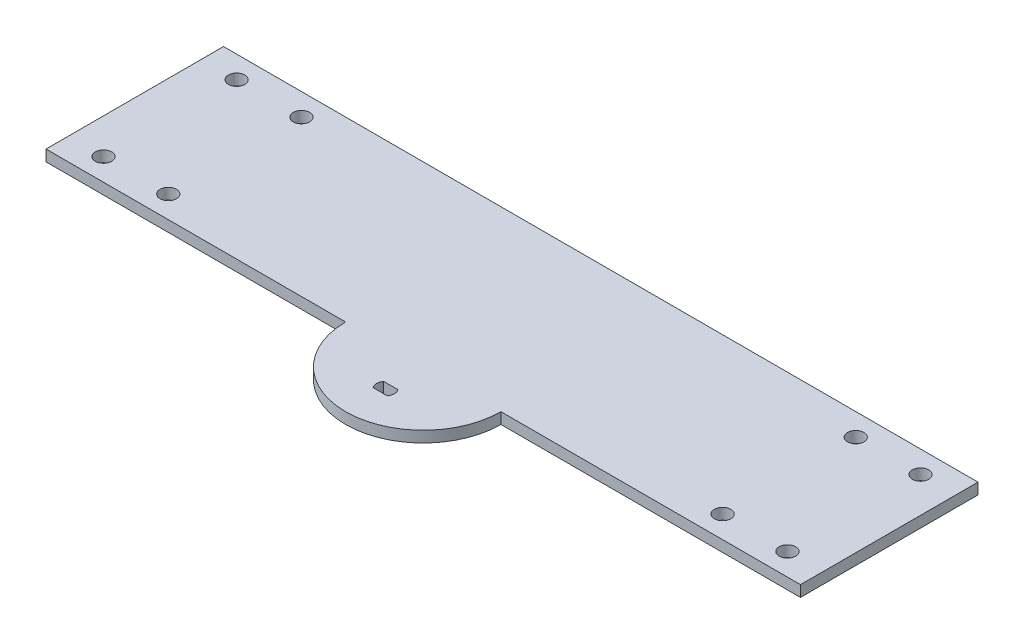
ISO-10303-21;
HEADER;
FILE_DESCRIPTION(('STEP AP214'),'2;1');
FILE_NAME('part.step','',(''),(''),'','','');
FILE_SCHEMA(('AUTOMOTIVE_DESIGN { 1 0 10303 214 1 1 1 1 }'));
ENDSEC;
DATA;
#1=APPLICATION_CONTEXT('core data for automotive mechanical design processes');
#2=APPLICATION_PROTOCOL_DEFINITION('international standard','automotive_design',2000,#1);
#3=PRODUCT_CONTEXT('',#1,'mechanical');
#4=PRODUCT('Part','Part','',(#3));
#5=PRODUCT_RELATED_PRODUCT_CATEGORY('part','',(#4));
#6=PRODUCT_DEFINITION_FORMATION('','',#4);
#7=PRODUCT_DEFINITION_CONTEXT('part definition',#1,'design');
#8=PRODUCT_DEFINITION('design','',#6,#7);
#9=PRODUCT_DEFINITION_SHAPE('','',#8);
#10=(LENGTH_UNIT() NAMED_UNIT(*) SI_UNIT(.MILLI.,.METRE.));
#11=(NAMED_UNIT(*) PLANE_ANGLE_UNIT() SI_UNIT($,.RADIAN.));
#12=(NAMED_UNIT(*) SI_UNIT($,.STERADIAN.) SOLID_ANGLE_UNIT());
#13=UNCERTAINTY_MEASURE_WITH_UNIT(LENGTH_MEASURE(1.E-05),#10,'distance_accuracy_value','');
#14=(GEOMETRIC_REPRESENTATION_CONTEXT(3) GLOBAL_UNCERTAINTY_ASSIGNED_CONTEXT((#13)) GLOBAL_UNIT_ASSIGNED_CONTEXT((#10,
#11,#12)) REPRESENTATION_CONTEXT('',''));
#15=CARTESIAN_POINT('',(0.,0.,0.));
#16=DIRECTION('',(0.,0.,1.));
#17=DIRECTION('',(1.,0.,0.));
#18=AXIS2_PLACEMENT_3D('',#15,#16,#17);
#19=CARTESIAN_POINT('',(0.,3.175,-10.795));
#20=DIRECTION('',(0.,1.,0.));
#21=DIRECTION('',(0.,0.,1.));
#22=AXIS2_PLACEMENT_3D('',#19,#20,#21);
#23=PLANE('',#22);
#24=CARTESIAN_POINT('',(-97.8535,3.175,-17.145));
#25=DIRECTION('',(0.,1.,0.));
#26=DIRECTION('',(0.,0.,1.));
#27=AXIS2_PLACEMENT_3D('',#24,#25,#26);
#28=CIRCLE('',#27,2.3495);
#29=CARTESIAN_POINT('',(-97.8535,3.175,-14.7955));
#30=VERTEX_POINT('',#29);
#31=EDGE_CURVE('E311',#30,#30,#28,.T.);
#32=ORIENTED_EDGE('',*,*,#31,.F.);
#33=EDGE_LOOP('',(#32));
#34=FACE_BOUND('',#33,.T.);
#35=CARTESIAN_POINT('',(-79.3115,3.175,-17.145));
#36=DIRECTION('',(0.,1.,0.));
#37=DIRECTION('',(0.,0.,1.));
#38=AXIS2_PLACEMENT_3D('',#35,#36,#37);
#39=CIRCLE('',#38,2.3495);
#40=CARTESIAN_POINT('',(-79.3115,3.175,-14.7955));
#41=VERTEX_POINT('',#40);
#42=EDGE_CURVE('E318',#41,#41,#39,.T.);
#43=ORIENTED_EDGE('',*,*,#42,.F.);
#44=EDGE_LOOP('',(#43));
#45=FACE_BOUND('',#44,.T.);
#46=CARTESIAN_POINT('',(-79.3115,3.175,-55.245));
#47=DIRECTION('',(0.,1.,0.));
#48=DIRECTION('',(0.,0.,1.));
#49=AXIS2_PLACEMENT_3D('',#46,#47,#48);
#50=CIRCLE('',#49,2.3495);
#51=CARTESIAN_POINT('',(-79.3115,3.175,-52.8955));
#52=VERTEX_POINT('',#51);
#53=EDGE_CURVE('E324',#52,#52,#50,.T.);
#54=ORIENTED_EDGE('',*,*,#53,.F.);
#55=EDGE_LOOP('',(#54));
#56=FACE_BOUND('',#55,.T.);
#57=CARTESIAN_POINT('',(79.3115,3.175,-55.245));
#58=DIRECTION('',(0.,1.,0.));
#59=DIRECTION('',(0.,0.,-1.));
#60=AXIS2_PLACEMENT_3D('',#57,#58,#59);
#61=CIRCLE('',#60,2.3495);
#62=CARTESIAN_POINT('',(79.3115,3.175,-57.5945));
#63=VERTEX_POINT('',#62);
#64=EDGE_CURVE('E295',#63,#63,#61,.T.);
#65=ORIENTED_EDGE('',*,*,#64,.F.);
#66=EDGE_LOOP('',(#65));
#67=FACE_BOUND('',#66,.T.);
#68=CARTESIAN_POINT('',(79.3115,3.175,-17.145));
#69=DIRECTION('',(0.,1.,0.));
#70=DIRECTION('',(0.,0.,-1.));
#71=AXIS2_PLACEMENT_3D('',#68,#69,#70);
#72=CIRCLE('',#71,2.3495);
#73=CARTESIAN_POINT('',(79.3115,3.175,-19.4945));
#74=VERTEX_POINT('',#73);
#75=EDGE_CURVE('E290',#74,#74,#72,.T.);
#76=ORIENTED_EDGE('',*,*,#75,.F.);
#77=EDGE_LOOP('',(#76));
#78=FACE_BOUND('',#77,.T.);
#79=CARTESIAN_POINT('',(97.8535,3.175,-17.145));
#80=DIRECTION('',(0.,1.,0.));
#81=DIRECTION('',(0.,0.,-1.));
#82=AXIS2_PLACEMENT_3D('',#79,#80,#81);
#83=CIRCLE('',#82,2.3495);
#84=CARTESIAN_POINT('',(97.8535,3.175,-19.4945));
#85=VERTEX_POINT('',#84);
#86=EDGE_CURVE('E297',#85,#85,#83,.T.);
#87=ORIENTED_EDGE('',*,*,#86,.F.);
#88=EDGE_LOOP('',(#87));
#89=FACE_BOUND('',#88,.T.);
#90=CARTESIAN_POINT('',(97.8535,3.175,-55.245));
#91=DIRECTION('',(0.,1.,0.));
#92=DIRECTION('',(0.,0.,-1.));
#93=AXIS2_PLACEMENT_3D('',#90,#91,#92);
#94=CIRCLE('',#93,2.3495);
#95=CARTESIAN_POINT('',(97.8535,3.175,-57.5945));
#96=VERTEX_POINT('',#95);
#97=EDGE_CURVE('E305',#96,#96,#94,.T.);
#98=ORIENTED_EDGE('',*,*,#97,.F.);
#99=EDGE_LOOP('',(#98));
#100=FACE_BOUND('',#99,.T.);
#101=CARTESIAN_POINT('',(-97.8535,3.175,-55.245));
#102=DIRECTION('',(0.,1.,0.));
#103=DIRECTION('',(0.,0.,1.));
#104=AXIS2_PLACEMENT_3D('',#101,#102,#103);
#105=CIRCLE('',#104,2.3495);
#106=CARTESIAN_POINT('',(-97.8535,3.175,-52.8955));
#107=VERTEX_POINT('',#106);
#108=EDGE_CURVE('E314',#107,#107,#105,.T.);
#109=ORIENTED_EDGE('',*,*,#108,.F.);
#110=EDGE_LOOP('',(#109));
#111=FACE_BOUND('',#110,.T.);
#112=DIRECTION('',(1.,0.,0.));
#113=VECTOR('',#112,1.);
#114=CARTESIAN_POINT('',(22.225,3.175,-10.795));
#115=LINE('',#114,#113);
#116=CARTESIAN_POINT('',(22.225,3.175,-10.795));
#117=VERTEX_POINT('',#116);
#118=CARTESIAN_POINT('',(107.95,3.175,-10.795));
#119=VERTEX_POINT('',#118);
#120=EDGE_CURVE('E155',#117,#119,#115,.T.);
#121=ORIENTED_EDGE('',*,*,#120,.T.);
#122=DIRECTION('',(0.,0.,-1.));
#123=VECTOR('',#122,1.);
#124=CARTESIAN_POINT('',(107.95,3.175,-61.595));
#125=LINE('',#124,#123);
#126=CARTESIAN_POINT('',(107.95,3.175,-61.595));
#127=VERTEX_POINT('',#126);
#128=EDGE_CURVE('E158',#119,#127,#125,.T.);
#129=ORIENTED_EDGE('',*,*,#128,.T.);
#130=DIRECTION('',(-1.,0.,0.));
#131=VECTOR('',#130,1.);
#132=CARTESIAN_POINT('',(-107.95,3.175,-61.595));
#133=LINE('',#132,#131);
#134=CARTESIAN_POINT('',(-107.95,3.175,-61.595));
#135=VERTEX_POINT('',#134);
#136=EDGE_CURVE('E161',#127,#135,#133,.T.);
#137=ORIENTED_EDGE('',*,*,#136,.T.);
#138=DIRECTION('',(0.,0.,1.));
#139=VECTOR('',#138,1.);
#140=CARTESIAN_POINT('',(-107.95,3.175,-61.595));
#141=LINE('',#140,#139);
#142=CARTESIAN_POINT('',(-107.95,3.175,-10.795));
#143=VERTEX_POINT('',#142);
#144=EDGE_CURVE('E163',#135,#143,#141,.T.);
#145=ORIENTED_EDGE('',*,*,#144,.T.);
#146=DIRECTION('',(1.,0.,0.));
#147=VECTOR('',#146,1.);
#148=CARTESIAN_POINT('',(-107.95,3.175,-10.795));
#149=LINE('',#148,#147);
#150=CARTESIAN_POINT('',(-22.225,3.175,-10.795));
#151=VERTEX_POINT('',#150);
#152=EDGE_CURVE('E165',#143,#151,#149,.T.);
#153=ORIENTED_EDGE('',*,*,#152,.T.);
#154=CARTESIAN_POINT('',(0.,3.175,-10.795));
#155=DIRECTION('',(0.,1.,0.));
#156=DIRECTION('',(0.,0.,1.));
#157=AXIS2_PLACEMENT_3D('',#154,#155,#156);
#158=CIRCLE('',#157,22.225);
#159=EDGE_CURVE('E167',#151,#117,#158,.T.);
#160=ORIENTED_EDGE('',*,*,#159,.T.);
#161=EDGE_LOOP('',(#121,#129,#137,#145,#153,#160));
#162=FACE_BOUND('',#161,.T.);
#163=DIRECTION('',(1.,0.,0.));
#164=VECTOR('',#163,1.);
#165=CARTESIAN_POINT('',(-2.032,3.175,1.524));
#166=LINE('',#165,#164);
#167=CARTESIAN_POINT('',(-2.032,3.175,1.524));
#168=VERTEX_POINT('',#167);
#169=CARTESIAN_POINT('',(2.032,3.175,1.524));
#170=VERTEX_POINT('',#169);
#171=EDGE_CURVE('E125',#168,#170,#166,.T.);
#172=ORIENTED_EDGE('',*,*,#171,.F.);
#173=CARTESIAN_POINT('',(0.,3.175,0.));
#174=DIRECTION('',(0.,1.,0.));
#175=DIRECTION('',(0.,0.,1.));
#176=AXIS2_PLACEMENT_3D('',#173,#174,#175);
#177=CIRCLE('',#176,2.54);
#178=CARTESIAN_POINT('',(-2.032,3.175,-1.524));
#179=VERTEX_POINT('',#178);
#180=EDGE_CURVE('E117',#179,#168,#177,.T.);
#181=ORIENTED_EDGE('',*,*,#180,.F.);
#182=DIRECTION('',(-1.,0.,0.));
#183=VECTOR('',#182,1.);
#184=CARTESIAN_POINT('',(-2.032,3.175,-1.524));
#185=LINE('',#184,#183);
#186=CARTESIAN_POINT('',(2.032,3.175,-1.524));
#187=VERTEX_POINT('',#186);
#188=EDGE_CURVE('E139',#187,#179,#185,.T.);
#189=ORIENTED_EDGE('',*,*,#188,.F.);
#190=CARTESIAN_POINT('',(0.,3.175,0.));
#191=DIRECTION('',(0.,1.,0.));
#192=DIRECTION('',(0.,0.,1.));
#193=AXIS2_PLACEMENT_3D('',#190,#191,#192);
#194=CIRCLE('',#193,2.54);
#195=EDGE_CURVE('E137',#170,#187,#194,.T.);
#196=ORIENTED_EDGE('',*,*,#195,.F.);
#197=EDGE_LOOP('',(#172,#181,#189,#196));
#198=FACE_BOUND('',#197,.T.);
#199=ADVANCED_FACE('F40',(#34,#45,#56,#67,#78,#89,#100,#111,#162,#198),#23,.T.);
#200=CARTESIAN_POINT('',(0.,0.,-10.795));
#201=DIRECTION('',(0.,1.,0.));
#202=DIRECTION('',(0.,0.,1.));
#203=AXIS2_PLACEMENT_3D('',#200,#201,#202);
#204=PLANE('',#203);
#205=CARTESIAN_POINT('',(-97.8535,0.,-17.145));
#206=DIRECTION('',(0.,1.,0.));
#207=DIRECTION('',(0.,0.,1.));
#208=AXIS2_PLACEMENT_3D('',#205,#206,#207);
#209=CIRCLE('',#208,2.3495);
#210=CARTESIAN_POINT('',(-97.8535,0.,-14.7955));
#211=VERTEX_POINT('',#210);
#212=EDGE_CURVE('E315',#211,#211,#209,.T.);
#213=ORIENTED_EDGE('',*,*,#212,.T.);
#214=EDGE_LOOP('',(#213));
#215=FACE_BOUND('',#214,.T.);
#216=CARTESIAN_POINT('',(-79.3115,0.,-17.145));
#217=DIRECTION('',(0.,1.,0.));
#218=DIRECTION('',(0.,0.,1.));
#219=AXIS2_PLACEMENT_3D('',#216,#217,#218);
#220=CIRCLE('',#219,2.3495);
#221=CARTESIAN_POINT('',(-79.3115,0.,-14.7955));
#222=VERTEX_POINT('',#221);
#223=EDGE_CURVE('E321',#222,#222,#220,.T.);
#224=ORIENTED_EDGE('',*,*,#223,.T.);
#225=EDGE_LOOP('',(#224));
#226=FACE_BOUND('',#225,.T.);
#227=CARTESIAN_POINT('',(-79.3115,0.,-55.245));
#228=DIRECTION('',(0.,1.,0.));
#229=DIRECTION('',(0.,0.,1.));
#230=AXIS2_PLACEMENT_3D('',#227,#228,#229);
#231=CIRCLE('',#230,2.3495);
#232=CARTESIAN_POINT('',(-79.3115,0.,-52.8955));
#233=VERTEX_POINT('',#232);
#234=EDGE_CURVE('E327',#233,#233,#231,.T.);
#235=ORIENTED_EDGE('',*,*,#234,.T.);
#236=EDGE_LOOP('',(#235));
#237=FACE_BOUND('',#236,.T.);
#238=CARTESIAN_POINT('',(79.3115,0.,-55.245));
#239=DIRECTION('',(0.,1.,0.));
#240=DIRECTION('',(0.,0.,-1.));
#241=AXIS2_PLACEMENT_3D('',#238,#239,#240);
#242=CIRCLE('',#241,2.3495);
#243=CARTESIAN_POINT('',(79.3115,0.,-57.5945));
#244=VERTEX_POINT('',#243);
#245=EDGE_CURVE('E292',#244,#244,#242,.T.);
#246=ORIENTED_EDGE('',*,*,#245,.T.);
#247=EDGE_LOOP('',(#246));
#248=FACE_BOUND('',#247,.T.);
#249=CARTESIAN_POINT('',(79.3115,0.,-17.145));
#250=DIRECTION('',(0.,1.,0.));
#251=DIRECTION('',(0.,0.,-1.));
#252=AXIS2_PLACEMENT_3D('',#249,#250,#251);
#253=CIRCLE('',#252,2.3495);
#254=CARTESIAN_POINT('',(79.3115,0.,-19.4945));
#255=VERTEX_POINT('',#254);
#256=EDGE_CURVE('E287',#255,#255,#253,.T.);
#257=ORIENTED_EDGE('',*,*,#256,.T.);
#258=EDGE_LOOP('',(#257));
#259=FACE_BOUND('',#258,.T.);
#260=CARTESIAN_POINT('',(97.8535,0.,-17.145));
#261=DIRECTION('',(0.,1.,0.));
#262=DIRECTION('',(0.,0.,-1.));
#263=AXIS2_PLACEMENT_3D('',#260,#261,#262);
#264=CIRCLE('',#263,2.3495);
#265=CARTESIAN_POINT('',(97.8535,0.,-19.4945));
#266=VERTEX_POINT('',#265);
#267=EDGE_CURVE('E302',#266,#266,#264,.T.);
#268=ORIENTED_EDGE('',*,*,#267,.T.);
#269=EDGE_LOOP('',(#268));
#270=FACE_BOUND('',#269,.T.);
#271=CARTESIAN_POINT('',(97.8535,0.,-55.245));
#272=DIRECTION('',(0.,1.,0.));
#273=DIRECTION('',(0.,0.,-1.));
#274=AXIS2_PLACEMENT_3D('',#271,#272,#273);
#275=CIRCLE('',#274,2.3495);
#276=CARTESIAN_POINT('',(97.8535,0.,-57.5945));
#277=VERTEX_POINT('',#276);
#278=EDGE_CURVE('E308',#277,#277,#275,.T.);
#279=ORIENTED_EDGE('',*,*,#278,.T.);
#280=EDGE_LOOP('',(#279));
#281=FACE_BOUND('',#280,.T.);
#282=CARTESIAN_POINT('',(-97.8535,0.,-55.245));
#283=DIRECTION('',(0.,1.,0.));
#284=DIRECTION('',(0.,0.,1.));
#285=AXIS2_PLACEMENT_3D('',#282,#283,#284);
#286=CIRCLE('',#285,2.3495);
#287=CARTESIAN_POINT('',(-97.8535,0.,-52.8955));
#288=VERTEX_POINT('',#287);
#289=EDGE_CURVE('E145',#288,#288,#286,.T.);
#290=ORIENTED_EDGE('',*,*,#289,.T.);
#291=EDGE_LOOP('',(#290));
#292=FACE_BOUND('',#291,.T.);
#293=DIRECTION('',(1.,0.,0.));
#294=VECTOR('',#293,1.);
#295=CARTESIAN_POINT('',(22.225,0.,-10.795));
#296=LINE('',#295,#294);
#297=CARTESIAN_POINT('',(22.225,0.,-10.795));
#298=VERTEX_POINT('',#297);
#299=CARTESIAN_POINT('',(107.95,0.,-10.795));
#300=VERTEX_POINT('',#299);
#301=EDGE_CURVE('E133',#298,#300,#296,.T.);
#302=ORIENTED_EDGE('',*,*,#301,.F.);
#303=CARTESIAN_POINT('',(0.,0.,-10.795));
#304=DIRECTION('',(0.,1.,0.));
#305=DIRECTION('',(0.,0.,1.));
#306=AXIS2_PLACEMENT_3D('',#303,#304,#305);
#307=CIRCLE('',#306,22.225);
#308=CARTESIAN_POINT('',(-22.225,0.,-10.795));
#309=VERTEX_POINT('',#308);
#310=EDGE_CURVE('E159',#309,#298,#307,.T.);
#311=ORIENTED_EDGE('',*,*,#310,.F.);
#312=DIRECTION('',(1.,0.,0.));
#313=VECTOR('',#312,1.);
#314=CARTESIAN_POINT('',(-107.95,0.,-10.795));
#315=LINE('',#314,#313);
#316=CARTESIAN_POINT('',(-107.95,0.,-10.795));
#317=VERTEX_POINT('',#316);
#318=EDGE_CURVE('E178',#317,#309,#315,.T.);
#319=ORIENTED_EDGE('',*,*,#318,.F.);
#320=DIRECTION('',(0.,0.,1.));
#321=VECTOR('',#320,1.);
#322=CARTESIAN_POINT('',(-107.95,0.,-61.595));
#323=LINE('',#322,#321);
#324=CARTESIAN_POINT('',(-107.95,0.,-61.595));
#325=VERTEX_POINT('',#324);
#326=EDGE_CURVE('E176',#325,#317,#323,.T.);
#327=ORIENTED_EDGE('',*,*,#326,.F.);
#328=DIRECTION('',(-1.,0.,0.));
#329=VECTOR('',#328,1.);
#330=CARTESIAN_POINT('',(-107.95,0.,-61.595));
#331=LINE('',#330,#329);
#332=CARTESIAN_POINT('',(107.95,0.,-61.595));
#333=VERTEX_POINT('',#332);
#334=EDGE_CURVE('E174',#333,#325,#331,.T.);
#335=ORIENTED_EDGE('',*,*,#334,.F.);
#336=DIRECTION('',(0.,0.,-1.));
#337=VECTOR('',#336,1.);
#338=CARTESIAN_POINT('',(107.95,0.,-61.595));
#339=LINE('',#338,#337);
#340=EDGE_CURVE('E172',#300,#333,#339,.T.);
#341=ORIENTED_EDGE('',*,*,#340,.F.);
#342=EDGE_LOOP('',(#302,#311,#319,#327,#335,#341));
#343=FACE_BOUND('',#342,.T.);
#344=CARTESIAN_POINT('',(0.,0.,0.));
#345=DIRECTION('',(0.,1.,0.));
#346=DIRECTION('',(0.,0.,1.));
#347=AXIS2_PLACEMENT_3D('',#344,#345,#346);
#348=CIRCLE('',#347,2.54);
#349=CARTESIAN_POINT('',(-2.032,0.,-1.524));
#350=VERTEX_POINT('',#349);
#351=CARTESIAN_POINT('',(-2.032,0.,1.524));
#352=VERTEX_POINT('',#351);
#353=EDGE_CURVE('E63',#350,#352,#348,.T.);
#354=ORIENTED_EDGE('',*,*,#353,.T.);
#355=DIRECTION('',(1.,0.,0.));
#356=VECTOR('',#355,1.);
#357=CARTESIAN_POINT('',(-2.032,0.,1.524));
#358=LINE('',#357,#356);
#359=CARTESIAN_POINT('',(2.032,0.,1.524));
#360=VERTEX_POINT('',#359);
#361=EDGE_CURVE('E132',#352,#360,#358,.T.);
#362=ORIENTED_EDGE('',*,*,#361,.T.);
#363=CARTESIAN_POINT('',(0.,0.,0.));
#364=DIRECTION('',(0.,1.,0.));
#365=DIRECTION('',(0.,0.,1.));
#366=AXIS2_PLACEMENT_3D('',#363,#364,#365);
#367=CIRCLE('',#366,2.54);
#368=CARTESIAN_POINT('',(2.032,0.,-1.524));
#369=VERTEX_POINT('',#368);
#370=EDGE_CURVE('E147',#360,#369,#367,.T.);
#371=ORIENTED_EDGE('',*,*,#370,.T.);
#372=DIRECTION('',(-1.,0.,0.));
#373=VECTOR('',#372,1.);
#374=CARTESIAN_POINT('',(-2.032,0.,-1.524));
#375=LINE('',#374,#373);
#376=EDGE_CURVE('E126',#369,#350,#375,.T.);
#377=ORIENTED_EDGE('',*,*,#376,.T.);
#378=EDGE_LOOP('',(#354,#362,#371,#377));
#379=FACE_BOUND('',#378,.T.);
#380=ADVANCED_FACE('F202',(#215,#226,#237,#248,#259,#270,#281,#292,#343,#379),#204,.F.);
#381=CARTESIAN_POINT('',(22.225,3.175,-10.795));
#382=DIRECTION('',(0.,0.,-1.));
#383=DIRECTION('',(-1.,0.,0.));
#384=AXIS2_PLACEMENT_3D('',#381,#382,#383);
#385=PLANE('',#384);
#386=ORIENTED_EDGE('',*,*,#301,.T.);
#387=DIRECTION('',(0.,-1.,0.));
#388=VECTOR('',#387,1.);
#389=CARTESIAN_POINT('',(107.95,3.175,-10.795));
#390=LINE('',#389,#388);
#391=EDGE_CURVE('E11',#119,#300,#390,.T.);
#392=ORIENTED_EDGE('',*,*,#391,.F.);
#393=ORIENTED_EDGE('',*,*,#120,.F.);
#394=DIRECTION('',(0.,-1.,0.));
#395=VECTOR('',#394,1.);
#396=CARTESIAN_POINT('',(22.225,3.175,-10.795));
#397=LINE('',#396,#395);
#398=EDGE_CURVE('E169',#117,#298,#397,.T.);
#399=ORIENTED_EDGE('',*,*,#398,.T.);
#400=EDGE_LOOP('',(#386,#392,#393,#399));
#401=FACE_BOUND('',#400,.T.);
#402=ADVANCED_FACE('F42',(#401),#385,.F.);
#403=CARTESIAN_POINT('',(107.95,3.175,-61.595));
#404=DIRECTION('',(-1.,0.,0.));
#405=DIRECTION('',(0.,0.,1.));
#406=AXIS2_PLACEMENT_3D('',#403,#404,#405);
#407=PLANE('',#406);
#408=ORIENTED_EDGE('',*,*,#340,.T.);
#409=DIRECTION('',(0.,-1.,0.));
#410=VECTOR('',#409,1.);
#411=CARTESIAN_POINT('',(107.95,3.175,-61.595));
#412=LINE('',#411,#410);
#413=EDGE_CURVE('E48',#127,#333,#412,.T.);
#414=ORIENTED_EDGE('',*,*,#413,.F.);
#415=ORIENTED_EDGE('',*,*,#128,.F.);
#416=ORIENTED_EDGE('',*,*,#391,.T.);
#417=EDGE_LOOP('',(#408,#414,#415,#416));
#418=FACE_BOUND('',#417,.T.);
#419=ADVANCED_FACE('F219',(#418),#407,.F.);
#420=CARTESIAN_POINT('',(-107.95,3.175,-61.595));
#421=DIRECTION('',(0.,0.,1.));
#422=DIRECTION('',(1.,0.,0.));
#423=AXIS2_PLACEMENT_3D('',#420,#421,#422);
#424=PLANE('',#423);
#425=ORIENTED_EDGE('',*,*,#334,.T.);
#426=DIRECTION('',(0.,-1.,0.));
#427=VECTOR('',#426,1.);
#428=CARTESIAN_POINT('',(-107.95,3.175,-61.595));
#429=LINE('',#428,#427);
#430=EDGE_CURVE('E189',#135,#325,#429,.T.);
#431=ORIENTED_EDGE('',*,*,#430,.F.);
#432=ORIENTED_EDGE('',*,*,#136,.F.);
#433=ORIENTED_EDGE('',*,*,#413,.T.);
#434=EDGE_LOOP('',(#425,#431,#432,#433));
#435=FACE_BOUND('',#434,.T.);
#436=ADVANCED_FACE('F196',(#435),#424,.F.);
#437=CARTESIAN_POINT('',(-107.95,3.175,-61.595));
#438=DIRECTION('',(1.,0.,0.));
#439=DIRECTION('',(0.,0.,-1.));
#440=AXIS2_PLACEMENT_3D('',#437,#438,#439);
#441=PLANE('',#440);
#442=ORIENTED_EDGE('',*,*,#326,.T.);
#443=DIRECTION('',(0.,-1.,0.));
#444=VECTOR('',#443,1.);
#445=CARTESIAN_POINT('',(-107.95,3.175,-10.795));
#446=LINE('',#445,#444);
#447=EDGE_CURVE('E186',#143,#317,#446,.T.);
#448=ORIENTED_EDGE('',*,*,#447,.F.);
#449=ORIENTED_EDGE('',*,*,#144,.F.);
#450=ORIENTED_EDGE('',*,*,#430,.T.);
#451=EDGE_LOOP('',(#442,#448,#449,#450));
#452=FACE_BOUND('',#451,.T.);
#453=ADVANCED_FACE('F208',(#452),#441,.F.);
#454=CARTESIAN_POINT('',(-107.95,3.175,-10.795));
#455=DIRECTION('',(0.,0.,-1.));
#456=DIRECTION('',(-1.,0.,0.));
#457=AXIS2_PLACEMENT_3D('',#454,#455,#456);
#458=PLANE('',#457);
#459=ORIENTED_EDGE('',*,*,#318,.T.);
#460=DIRECTION('',(0.,-1.,0.));
#461=VECTOR('',#460,1.);
#462=CARTESIAN_POINT('',(-22.225,3.175,-10.795));
#463=LINE('',#462,#461);
#464=EDGE_CURVE('E183',#151,#309,#463,.T.);
#465=ORIENTED_EDGE('',*,*,#464,.F.);
#466=ORIENTED_EDGE('',*,*,#152,.F.);
#467=ORIENTED_EDGE('',*,*,#447,.T.);
#468=EDGE_LOOP('',(#459,#465,#466,#467));
#469=FACE_BOUND('',#468,.T.);
#470=ADVANCED_FACE('F212',(#469),#458,.F.);
#471=CARTESIAN_POINT('',(0.,3.175,-10.795));
#472=DIRECTION('',(0.,-1.,0.));
#473=DIRECTION('',(0.,0.,-1.));
#474=AXIS2_PLACEMENT_3D('',#471,#472,#473);
#475=CYLINDRICAL_SURFACE('',#474,22.225);
#476=ORIENTED_EDGE('',*,*,#310,.T.);
#477=ORIENTED_EDGE('',*,*,#398,.F.);
#478=ORIENTED_EDGE('',*,*,#159,.F.);
#479=ORIENTED_EDGE('',*,*,#464,.T.);
#480=EDGE_LOOP('',(#476,#477,#478,#479));
#481=FACE_BOUND('',#480,.T.);
#482=ADVANCED_FACE('F222',(#481),#475,.T.);
#483=CARTESIAN_POINT('',(0.,3.175,0.));
#484=DIRECTION('',(0.,-1.,0.));
#485=DIRECTION('',(0.,0.,-1.));
#486=AXIS2_PLACEMENT_3D('',#483,#484,#485);
#487=CYLINDRICAL_SURFACE('',#486,2.54);
#488=ORIENTED_EDGE('',*,*,#353,.F.);
#489=DIRECTION('',(0.,-1.,0.));
#490=VECTOR('',#489,1.);
#491=CARTESIAN_POINT('',(-2.032,3.175,-1.524));
#492=LINE('',#491,#490);
#493=EDGE_CURVE('E121',#179,#350,#492,.T.);
#494=ORIENTED_EDGE('',*,*,#493,.F.);
#495=ORIENTED_EDGE('',*,*,#180,.T.);
#496=DIRECTION('',(0.,-1.,0.));
#497=VECTOR('',#496,1.);
#498=CARTESIAN_POINT('',(-2.032,3.175,1.524));
#499=LINE('',#498,#497);
#500=EDGE_CURVE('E120',#168,#352,#499,.T.);
#501=ORIENTED_EDGE('',*,*,#500,.T.);
#502=EDGE_LOOP('',(#488,#494,#495,#501));
#503=FACE_BOUND('',#502,.T.);
#504=ADVANCED_FACE('F119',(#503),#487,.F.);
#505=CARTESIAN_POINT('',(-2.032,3.175,1.524));
#506=DIRECTION('',(0.,0.,-1.));
#507=DIRECTION('',(-1.,0.,0.));
#508=AXIS2_PLACEMENT_3D('',#505,#506,#507);
#509=PLANE('',#508);
#510=ORIENTED_EDGE('',*,*,#361,.F.);
#511=ORIENTED_EDGE('',*,*,#500,.F.);
#512=ORIENTED_EDGE('',*,*,#171,.T.);
#513=DIRECTION('',(0.,-1.,0.));
#514=VECTOR('',#513,1.);
#515=CARTESIAN_POINT('',(2.032,3.175,1.524));
#516=LINE('',#515,#514);
#517=EDGE_CURVE('E134',#170,#360,#516,.T.);
#518=ORIENTED_EDGE('',*,*,#517,.T.);
#519=EDGE_LOOP('',(#510,#511,#512,#518));
#520=FACE_BOUND('',#519,.T.);
#521=ADVANCED_FACE('F129',(#520),#509,.T.);
#522=CARTESIAN_POINT('',(0.,3.175,0.));
#523=DIRECTION('',(0.,-1.,0.));
#524=DIRECTION('',(0.,0.,-1.));
#525=AXIS2_PLACEMENT_3D('',#522,#523,#524);
#526=CYLINDRICAL_SURFACE('',#525,2.54);
#527=ORIENTED_EDGE('',*,*,#370,.F.);
#528=ORIENTED_EDGE('',*,*,#517,.F.);
#529=ORIENTED_EDGE('',*,*,#195,.T.);
#530=DIRECTION('',(0.,-1.,0.));
#531=VECTOR('',#530,1.);
#532=CARTESIAN_POINT('',(2.032,3.175,-1.524));
#533=LINE('',#532,#531);
#534=EDGE_CURVE('E55',#187,#369,#533,.T.);
#535=ORIENTED_EDGE('',*,*,#534,.T.);
#536=EDGE_LOOP('',(#527,#528,#529,#535));
#537=FACE_BOUND('',#536,.T.);
#538=ADVANCED_FACE('F245',(#537),#526,.F.);
#539=CARTESIAN_POINT('',(-2.032,3.175,-1.524));
#540=DIRECTION('',(0.,0.,1.));
#541=DIRECTION('',(1.,0.,0.));
#542=AXIS2_PLACEMENT_3D('',#539,#540,#541);
#543=PLANE('',#542);
#544=ORIENTED_EDGE('',*,*,#376,.F.);
#545=ORIENTED_EDGE('',*,*,#534,.F.);
#546=ORIENTED_EDGE('',*,*,#188,.T.);
#547=ORIENTED_EDGE('',*,*,#493,.T.);
#548=EDGE_LOOP('',(#544,#545,#546,#547));
#549=FACE_BOUND('',#548,.T.);
#550=ADVANCED_FACE('F248',(#549),#543,.T.);
#551=CARTESIAN_POINT('',(-97.8535,0.,-55.245));
#552=DIRECTION('',(0.,1.,0.));
#553=DIRECTION('',(0.,0.,1.));
#554=AXIS2_PLACEMENT_3D('',#551,#552,#553);
#555=CYLINDRICAL_SURFACE('',#554,2.3495);
#556=ORIENTED_EDGE('',*,*,#289,.F.);
#557=EDGE_LOOP('',(#556));
#558=FACE_BOUND('',#557,.T.);
#559=ORIENTED_EDGE('',*,*,#108,.T.);
#560=EDGE_LOOP('',(#559));
#561=FACE_BOUND('',#560,.T.);
#562=ADVANCED_FACE('F251',(#558,#561),#555,.F.);
#563=CARTESIAN_POINT('',(97.8535,0.,-55.245));
#564=DIRECTION('',(0.,1.,0.));
#565=DIRECTION('',(0.,0.,1.));
#566=AXIS2_PLACEMENT_3D('',#563,#564,#565);
#567=CYLINDRICAL_SURFACE('',#566,2.3495);
#568=ORIENTED_EDGE('',*,*,#278,.F.);
#569=EDGE_LOOP('',(#568));
#570=FACE_BOUND('',#569,.T.);
#571=ORIENTED_EDGE('',*,*,#97,.T.);
#572=EDGE_LOOP('',(#571));
#573=FACE_BOUND('',#572,.T.);
#574=ADVANCED_FACE('F254',(#570,#573),#567,.F.);
#575=CARTESIAN_POINT('',(97.8535,0.,-17.145));
#576=DIRECTION('',(0.,1.,0.));
#577=DIRECTION('',(0.,0.,1.));
#578=AXIS2_PLACEMENT_3D('',#575,#576,#577);
#579=CYLINDRICAL_SURFACE('',#578,2.3495);
#580=ORIENTED_EDGE('',*,*,#267,.F.);
#581=EDGE_LOOP('',(#580));
#582=FACE_BOUND('',#581,.T.);
#583=ORIENTED_EDGE('',*,*,#86,.T.);
#584=EDGE_LOOP('',(#583));
#585=FACE_BOUND('',#584,.T.);
#586=ADVANCED_FACE('F275',(#582,#585),#579,.F.);
#587=CARTESIAN_POINT('',(79.3115,0.,-17.145));
#588=DIRECTION('',(0.,1.,0.));
#589=DIRECTION('',(0.,0.,1.));
#590=AXIS2_PLACEMENT_3D('',#587,#588,#589);
#591=CYLINDRICAL_SURFACE('',#590,2.3495);
#592=ORIENTED_EDGE('',*,*,#256,.F.);
#593=EDGE_LOOP('',(#592));
#594=FACE_BOUND('',#593,.T.);
#595=ORIENTED_EDGE('',*,*,#75,.T.);
#596=EDGE_LOOP('',(#595));
#597=FACE_BOUND('',#596,.T.);
#598=ADVANCED_FACE('F260',(#594,#597),#591,.F.);
#599=CARTESIAN_POINT('',(79.3115,0.,-55.245));
#600=DIRECTION('',(0.,1.,0.));
#601=DIRECTION('',(0.,0.,1.));
#602=AXIS2_PLACEMENT_3D('',#599,#600,#601);
#603=CYLINDRICAL_SURFACE('',#602,2.3495);
#604=ORIENTED_EDGE('',*,*,#245,.F.);
#605=EDGE_LOOP('',(#604));
#606=FACE_BOUND('',#605,.T.);
#607=ORIENTED_EDGE('',*,*,#64,.T.);
#608=EDGE_LOOP('',(#607));
#609=FACE_BOUND('',#608,.T.);
#610=ADVANCED_FACE('F256',(#606,#609),#603,.F.);
#611=CARTESIAN_POINT('',(-79.3115,0.,-55.245));
#612=DIRECTION('',(0.,1.,0.));
#613=DIRECTION('',(0.,0.,1.));
#614=AXIS2_PLACEMENT_3D('',#611,#612,#613);
#615=CYLINDRICAL_SURFACE('',#614,2.3495);
#616=ORIENTED_EDGE('',*,*,#234,.F.);
#617=EDGE_LOOP('',(#616));
#618=FACE_BOUND('',#617,.T.);
#619=ORIENTED_EDGE('',*,*,#53,.T.);
#620=EDGE_LOOP('',(#619));
#621=FACE_BOUND('',#620,.T.);
#622=ADVANCED_FACE('F259',(#618,#621),#615,.F.);
#623=CARTESIAN_POINT('',(-79.3115,0.,-17.145));
#624=DIRECTION('',(0.,1.,0.));
#625=DIRECTION('',(0.,0.,1.));
#626=AXIS2_PLACEMENT_3D('',#623,#624,#625);
#627=CYLINDRICAL_SURFACE('',#626,2.3495);
#628=ORIENTED_EDGE('',*,*,#223,.F.);
#629=EDGE_LOOP('',(#628));
#630=FACE_BOUND('',#629,.T.);
#631=ORIENTED_EDGE('',*,*,#42,.T.);
#632=EDGE_LOOP('',(#631));
#633=FACE_BOUND('',#632,.T.);
#634=ADVANCED_FACE('F264',(#630,#633),#627,.F.);
#635=CARTESIAN_POINT('',(-97.8535,0.,-17.145));
#636=DIRECTION('',(0.,1.,0.));
#637=DIRECTION('',(0.,0.,1.));
#638=AXIS2_PLACEMENT_3D('',#635,#636,#637);
#639=CYLINDRICAL_SURFACE('',#638,2.3495);
#640=ORIENTED_EDGE('',*,*,#212,.F.);
#641=EDGE_LOOP('',(#640));
#642=FACE_BOUND('',#641,.T.);
#643=ORIENTED_EDGE('',*,*,#31,.T.);
#644=EDGE_LOOP('',(#643));
#645=FACE_BOUND('',#644,.T.);
#646=ADVANCED_FACE('F268',(#642,#645),#639,.F.);
#647=CLOSED_SHELL('',(#199,#380,#402,#419,#436,#453,#470,#482,#504,#521,#538,#550,#562,#574,
#586,#598,#610,#622,#634,#646));
#648=MANIFOLD_SOLID_BREP('B2',#647);
#649=ADVANCED_BREP_SHAPE_REPRESENTATION('',(#18,#648),#14);
#650=SHAPE_DEFINITION_REPRESENTATION(#9,#649);
ENDSEC;
END-ISO-10303-21;
